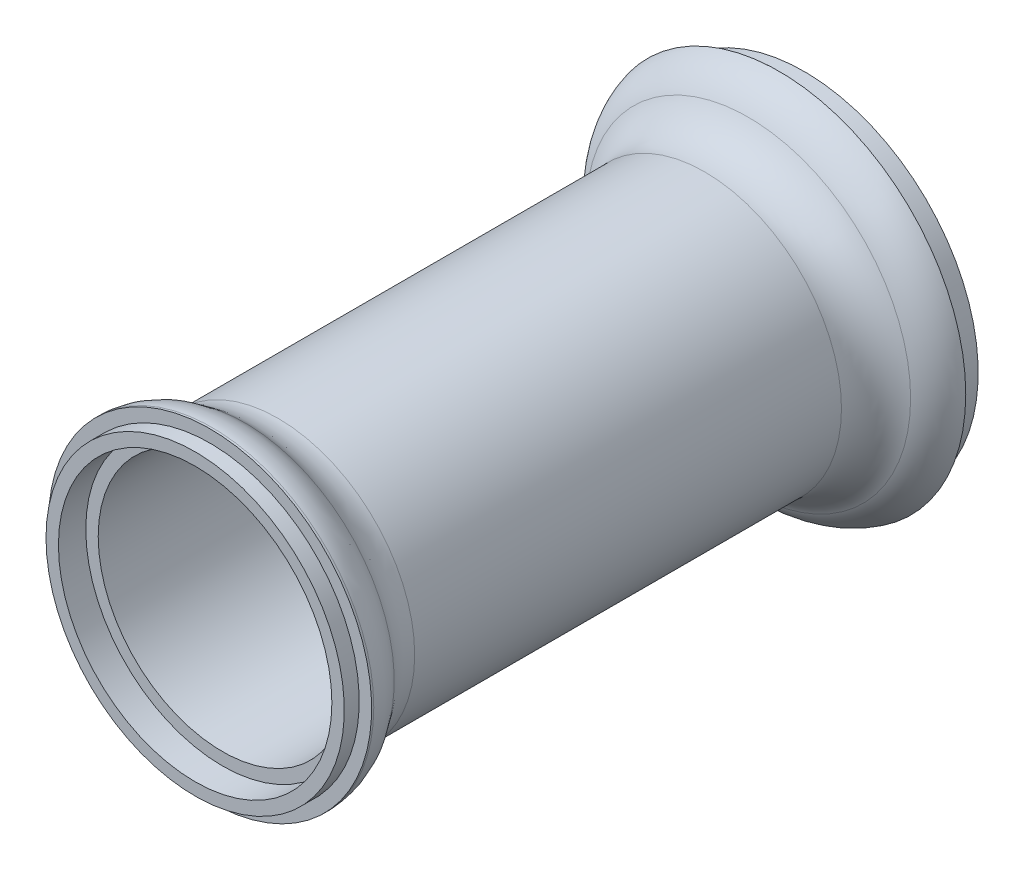
ISO-10303-21;
HEADER;
FILE_DESCRIPTION(('STEP AP214'),'2;1');
FILE_NAME('part.step','',(''),(''),'','','');
FILE_SCHEMA(('AUTOMOTIVE_DESIGN { 1 0 10303 214 1 1 1 1 }'));
ENDSEC;
DATA;
#1=APPLICATION_CONTEXT('core data for automotive mechanical design processes');
#2=APPLICATION_PROTOCOL_DEFINITION('international standard','automotive_design',2000,#1);
#3=PRODUCT_CONTEXT('',#1,'mechanical');
#4=PRODUCT('Part','Part','',(#3));
#5=PRODUCT_RELATED_PRODUCT_CATEGORY('part','',(#4));
#6=PRODUCT_DEFINITION_FORMATION('','',#4);
#7=PRODUCT_DEFINITION_CONTEXT('part definition',#1,'design');
#8=PRODUCT_DEFINITION('design','',#6,#7);
#9=PRODUCT_DEFINITION_SHAPE('','',#8);
#10=(LENGTH_UNIT() NAMED_UNIT(*) SI_UNIT(.MILLI.,.METRE.));
#11=(NAMED_UNIT(*) PLANE_ANGLE_UNIT() SI_UNIT($,.RADIAN.));
#12=(NAMED_UNIT(*) SI_UNIT($,.STERADIAN.) SOLID_ANGLE_UNIT());
#13=UNCERTAINTY_MEASURE_WITH_UNIT(LENGTH_MEASURE(1.E-05),#10,'distance_accuracy_value','');
#14=(GEOMETRIC_REPRESENTATION_CONTEXT(3) GLOBAL_UNCERTAINTY_ASSIGNED_CONTEXT((#13)) GLOBAL_UNIT_ASSIGNED_CONTEXT((#10,
#11,#12)) REPRESENTATION_CONTEXT('',''));
#15=CARTESIAN_POINT('',(0.,0.,0.));
#16=DIRECTION('',(0.,0.,1.));
#17=DIRECTION('',(1.,0.,0.));
#18=AXIS2_PLACEMENT_3D('',#15,#16,#17);
#19=CARTESIAN_POINT('',(35.,0.,0.));
#20=DIRECTION('',(0.,0.,1.));
#21=DIRECTION('',(1.,0.,0.));
#22=AXIS2_PLACEMENT_3D('',#19,#20,#21);
#23=PLANE('',#22);
#24=CARTESIAN_POINT('',(0.,0.,0.));
#25=DIRECTION('',(0.,0.,1.));
#26=DIRECTION('',(1.,0.,0.));
#27=AXIS2_PLACEMENT_3D('',#24,#25,#26);
#28=CIRCLE('',#27,32.5);
#29=CARTESIAN_POINT('',(32.5,0.,0.));
#30=VERTEX_POINT('',#29);
#31=EDGE_CURVE('E76',#30,#30,#28,.F.);
#32=ORIENTED_EDGE('',*,*,#31,.F.);
#33=EDGE_LOOP('',(#32));
#34=FACE_BOUND('',#33,.T.);
#35=CARTESIAN_POINT('',(0.,0.,0.));
#36=DIRECTION('',(0.,0.,-1.));
#37=DIRECTION('',(-1.,0.,0.));
#38=AXIS2_PLACEMENT_3D('',#35,#36,#37);
#39=CIRCLE('',#38,35.);
#40=CARTESIAN_POINT('',(-35.,0.,0.));
#41=VERTEX_POINT('',#40);
#42=EDGE_CURVE('E72',#41,#41,#39,.T.);
#43=ORIENTED_EDGE('',*,*,#42,.T.);
#44=EDGE_LOOP('',(#43));
#45=FACE_BOUND('',#44,.T.);
#46=ADVANCED_FACE('F34',(#34,#45),#23,.F.);
#47=CARTESIAN_POINT('',(0.,0.,122.5));
#48=DIRECTION('',(0.,0.,-1.));
#49=DIRECTION('',(-1.,0.,0.));
#50=AXIS2_PLACEMENT_3D('',#47,#48,#49);
#51=PLANE('',#50);
#52=CARTESIAN_POINT('',(0.,0.,122.5));
#53=DIRECTION('',(0.,0.,-1.));
#54=DIRECTION('',(-1.,0.,0.));
#55=AXIS2_PLACEMENT_3D('',#52,#53,#54);
#56=CIRCLE('',#55,27.5);
#57=CARTESIAN_POINT('',(-27.5,0.,122.5));
#58=VERTEX_POINT('',#57);
#59=EDGE_CURVE('E75',#58,#58,#56,.T.);
#60=ORIENTED_EDGE('',*,*,#59,.T.);
#61=EDGE_LOOP('',(#60));
#62=FACE_BOUND('',#61,.T.);
#63=CARTESIAN_POINT('',(0.,0.,122.5));
#64=DIRECTION('',(0.,0.,-1.));
#65=DIRECTION('',(-1.,0.,0.));
#66=AXIS2_PLACEMENT_3D('',#63,#64,#65);
#67=CIRCLE('',#66,30.);
#68=CARTESIAN_POINT('',(-30.,0.,122.5));
#69=VERTEX_POINT('',#68);
#70=EDGE_CURVE('E57',#69,#69,#67,.T.);
#71=ORIENTED_EDGE('',*,*,#70,.F.);
#72=EDGE_LOOP('',(#71));
#73=FACE_BOUND('',#72,.T.);
#74=ADVANCED_FACE('F115',(#62,#73),#51,.F.);
#75=CARTESIAN_POINT('',(0.,0.,0.));
#76=DIRECTION('',(0.,0.,-1.));
#77=DIRECTION('',(-1.,0.,0.));
#78=AXIS2_PLACEMENT_3D('',#75,#76,#77);
#79=CYLINDRICAL_SURFACE('',#78,30.);
#80=CARTESIAN_POINT('',(0.,0.,119.5));
#81=DIRECTION('',(0.,0.,-1.));
#82=DIRECTION('',(-1.,0.,0.));
#83=AXIS2_PLACEMENT_3D('',#80,#81,#82);
#84=CIRCLE('',#83,30.);
#85=CARTESIAN_POINT('',(-30.,0.,119.5));
#86=VERTEX_POINT('',#85);
#87=EDGE_CURVE('E60',#86,#86,#84,.T.);
#88=ORIENTED_EDGE('',*,*,#87,.F.);
#89=EDGE_LOOP('',(#88));
#90=FACE_BOUND('',#89,.T.);
#91=ORIENTED_EDGE('',*,*,#70,.T.);
#92=EDGE_LOOP('',(#91));
#93=FACE_BOUND('',#92,.T.);
#94=ADVANCED_FACE('F121',(#90,#93),#79,.T.);
#95=CARTESIAN_POINT('',(30.,0.,119.5));
#96=DIRECTION('',(0.,0.,-1.));
#97=DIRECTION('',(-1.,0.,0.));
#98=AXIS2_PLACEMENT_3D('',#95,#96,#97);
#99=PLANE('',#98);
#100=CARTESIAN_POINT('',(0.,0.,119.5));
#101=DIRECTION('',(0.,0.,-1.));
#102=DIRECTION('',(-1.,0.,0.));
#103=AXIS2_PLACEMENT_3D('',#100,#101,#102);
#104=CIRCLE('',#103,32.5);
#105=CARTESIAN_POINT('',(-32.5,0.,119.5));
#106=VERTEX_POINT('',#105);
#107=EDGE_CURVE('E63',#106,#106,#104,.T.);
#108=ORIENTED_EDGE('',*,*,#107,.F.);
#109=EDGE_LOOP('',(#108));
#110=FACE_BOUND('',#109,.T.);
#111=ORIENTED_EDGE('',*,*,#87,.T.);
#112=EDGE_LOOP('',(#111));
#113=FACE_BOUND('',#112,.T.);
#114=ADVANCED_FACE('F159',(#110,#113),#99,.F.);
#115=CARTESIAN_POINT('',(0.,0.,0.));
#116=DIRECTION('',(0.,0.,-1.));
#117=DIRECTION('',(-1.,0.,0.));
#118=AXIS2_PLACEMENT_3D('',#115,#116,#117);
#119=CYLINDRICAL_SURFACE('',#118,32.5);
#120=CARTESIAN_POINT('',(0.,0.,119.068502517479));
#121=DIRECTION('',(0.,0.,1.));
#122=DIRECTION('',(1.,0.,0.));
#123=AXIS2_PLACEMENT_3D('',#120,#121,#122);
#124=CIRCLE('',#123,32.5);
#125=CARTESIAN_POINT('',(32.5,0.,119.068502517479));
#126=VERTEX_POINT('',#125);
#127=EDGE_CURVE('E41',#126,#126,#124,.T.);
#128=ORIENTED_EDGE('',*,*,#127,.T.);
#129=EDGE_LOOP('',(#128));
#130=FACE_BOUND('',#129,.T.);
#131=ORIENTED_EDGE('',*,*,#107,.T.);
#132=EDGE_LOOP('',(#131));
#133=FACE_BOUND('',#132,.T.);
#134=ADVANCED_FACE('F149',(#130,#133),#119,.T.);
#135=CARTESIAN_POINT('',(0.,0.,0.));
#136=DIRECTION('',(0.,0.,-1.));
#137=DIRECTION('',(-1.,0.,0.));
#138=AXIS2_PLACEMENT_3D('',#135,#136,#137);
#139=CYLINDRICAL_SURFACE('',#138,27.5);
#140=CARTESIAN_POINT('',(0.,0.,20.));
#141=DIRECTION('',(0.,0.,-1.));
#142=DIRECTION('',(-1.,0.,0.));
#143=AXIS2_PLACEMENT_3D('',#140,#141,#142);
#144=CIRCLE('',#143,27.5);
#145=CARTESIAN_POINT('',(-27.5,0.,20.));
#146=VERTEX_POINT('',#145);
#147=EDGE_CURVE('E49',#146,#146,#144,.F.);
#148=ORIENTED_EDGE('',*,*,#147,.T.);
#149=EDGE_LOOP('',(#148));
#150=FACE_BOUND('',#149,.T.);
#151=CARTESIAN_POINT('',(0.,0.,105.839745962156));
#152=DIRECTION('',(0.,0.,1.));
#153=DIRECTION('',(1.,0.,0.));
#154=AXIS2_PLACEMENT_3D('',#151,#152,#153);
#155=CIRCLE('',#154,27.5);
#156=CARTESIAN_POINT('',(27.5,0.,105.839745962156));
#157=VERTEX_POINT('',#156);
#158=EDGE_CURVE('E54',#157,#157,#155,.F.);
#159=ORIENTED_EDGE('',*,*,#158,.T.);
#160=EDGE_LOOP('',(#159));
#161=FACE_BOUND('',#160,.T.);
#162=ADVANCED_FACE('F146',(#150,#161),#139,.T.);
#163=CARTESIAN_POINT('',(37.5,0.,5.));
#164=DIRECTION('',(0.,0.,1.));
#165=DIRECTION('',(1.,0.,0.));
#166=AXIS2_PLACEMENT_3D('',#163,#164,#165);
#167=PLANE('',#166);
#168=CARTESIAN_POINT('',(0.,0.,5.));
#169=DIRECTION('',(0.,0.,-1.));
#170=DIRECTION('',(-1.,0.,0.));
#171=AXIS2_PLACEMENT_3D('',#168,#169,#170);
#172=CIRCLE('',#171,35.);
#173=CARTESIAN_POINT('',(-35.,0.,5.00000000000001));
#174=VERTEX_POINT('',#173);
#175=EDGE_CURVE('E69',#174,#174,#172,.T.);
#176=ORIENTED_EDGE('',*,*,#175,.F.);
#177=EDGE_LOOP('',(#176));
#178=FACE_BOUND('',#177,.T.);
#179=CARTESIAN_POINT('',(0.,0.,5.));
#180=DIRECTION('',(0.,0.,-1.));
#181=DIRECTION('',(-1.,0.,0.));
#182=AXIS2_PLACEMENT_3D('',#179,#180,#181);
#183=CIRCLE('',#182,37.5);
#184=CARTESIAN_POINT('',(-37.5,0.,5.00000000000001));
#185=VERTEX_POINT('',#184);
#186=EDGE_CURVE('E66',#185,#185,#183,.T.);
#187=ORIENTED_EDGE('',*,*,#186,.T.);
#188=EDGE_LOOP('',(#187));
#189=FACE_BOUND('',#188,.T.);
#190=ADVANCED_FACE('F148',(#178,#189),#167,.F.);
#191=CARTESIAN_POINT('',(0.,0.,0.));
#192=DIRECTION('',(0.,0.,-1.));
#193=DIRECTION('',(-1.,0.,0.));
#194=AXIS2_PLACEMENT_3D('',#191,#192,#193);
#195=CYLINDRICAL_SURFACE('',#194,35.);
#196=ORIENTED_EDGE('',*,*,#42,.F.);
#197=EDGE_LOOP('',(#196));
#198=FACE_BOUND('',#197,.T.);
#199=ORIENTED_EDGE('',*,*,#175,.T.);
#200=EDGE_LOOP('',(#199));
#201=FACE_BOUND('',#200,.T.);
#202=ADVANCED_FACE('F156',(#198,#201),#195,.T.);
#203=CARTESIAN_POINT('',(0.,0.,0.));
#204=DIRECTION('',(0.,0.,-1.));
#205=DIRECTION('',(-1.,0.,0.));
#206=AXIS2_PLACEMENT_3D('',#203,#204,#205);
#207=CYLINDRICAL_SURFACE('',#206,27.5);
#208=CARTESIAN_POINT('',(0.,0.,117.));
#209=DIRECTION('',(0.,0.,-1.));
#210=DIRECTION('',(-1.,0.,0.));
#211=AXIS2_PLACEMENT_3D('',#208,#209,#210);
#212=CIRCLE('',#211,27.5);
#213=CARTESIAN_POINT('',(-27.5,0.,117.));
#214=VERTEX_POINT('',#213);
#215=EDGE_CURVE('E82',#214,#214,#212,.T.);
#216=ORIENTED_EDGE('',*,*,#215,.T.);
#217=EDGE_LOOP('',(#216));
#218=FACE_BOUND('',#217,.T.);
#219=ORIENTED_EDGE('',*,*,#59,.F.);
#220=EDGE_LOOP('',(#219));
#221=FACE_BOUND('',#220,.T.);
#222=ADVANCED_FACE('F94',(#218,#221),#207,.F.);
#223=CARTESIAN_POINT('',(32.5,0.,117.));
#224=DIRECTION('',(0.,0.,1.));
#225=DIRECTION('',(1.,0.,0.));
#226=AXIS2_PLACEMENT_3D('',#223,#224,#225);
#227=PLANE('',#226);
#228=ORIENTED_EDGE('',*,*,#215,.F.);
#229=EDGE_LOOP('',(#228));
#230=FACE_BOUND('',#229,.T.);
#231=CARTESIAN_POINT('',(0.,0.,117.));
#232=DIRECTION('',(0.,0.,1.));
#233=DIRECTION('',(1.,0.,0.));
#234=AXIS2_PLACEMENT_3D('',#231,#232,#233);
#235=CIRCLE('',#234,25.);
#236=CARTESIAN_POINT('',(25.,0.,117.));
#237=VERTEX_POINT('',#236);
#238=EDGE_CURVE('E88',#237,#237,#235,.F.);
#239=ORIENTED_EDGE('',*,*,#238,.T.);
#240=EDGE_LOOP('',(#239));
#241=FACE_BOUND('',#240,.T.);
#242=ADVANCED_FACE('F97',(#230,#241),#227,.T.);
#243=CARTESIAN_POINT('',(0.,0.,0.));
#244=DIRECTION('',(0.,0.,-1.));
#245=DIRECTION('',(-1.,0.,0.));
#246=AXIS2_PLACEMENT_3D('',#243,#244,#245);
#247=CYLINDRICAL_SURFACE('',#246,25.);
#248=CARTESIAN_POINT('',(0.,0.,7.5));
#249=DIRECTION('',(0.,0.,-1.));
#250=DIRECTION('',(-1.,0.,0.));
#251=AXIS2_PLACEMENT_3D('',#248,#249,#250);
#252=CIRCLE('',#251,25.);
#253=CARTESIAN_POINT('',(-25.,0.,7.50000000000001));
#254=VERTEX_POINT('',#253);
#255=EDGE_CURVE('E85',#254,#254,#252,.T.);
#256=ORIENTED_EDGE('',*,*,#255,.T.);
#257=EDGE_LOOP('',(#256));
#258=FACE_BOUND('',#257,.T.);
#259=ORIENTED_EDGE('',*,*,#238,.F.);
#260=EDGE_LOOP('',(#259));
#261=FACE_BOUND('',#260,.T.);
#262=ADVANCED_FACE('F100',(#258,#261),#247,.F.);
#263=CARTESIAN_POINT('',(27.5,0.,7.5));
#264=DIRECTION('',(0.,0.,-1.));
#265=DIRECTION('',(-1.,0.,0.));
#266=AXIS2_PLACEMENT_3D('',#263,#264,#265);
#267=PLANE('',#266);
#268=CARTESIAN_POINT('',(0.,0.,7.5));
#269=DIRECTION('',(0.,0.,1.));
#270=DIRECTION('',(1.,0.,0.));
#271=AXIS2_PLACEMENT_3D('',#268,#269,#270);
#272=CIRCLE('',#271,32.5);
#273=CARTESIAN_POINT('',(32.5,0.,7.5));
#274=VERTEX_POINT('',#273);
#275=EDGE_CURVE('E79',#274,#274,#272,.F.);
#276=ORIENTED_EDGE('',*,*,#275,.T.);
#277=EDGE_LOOP('',(#276));
#278=FACE_BOUND('',#277,.T.);
#279=ORIENTED_EDGE('',*,*,#255,.F.);
#280=EDGE_LOOP('',(#279));
#281=FACE_BOUND('',#280,.T.);
#282=ADVANCED_FACE('F105',(#278,#281),#267,.T.);
#283=CARTESIAN_POINT('',(0.,0.,0.));
#284=DIRECTION('',(0.,0.,-1.));
#285=DIRECTION('',(-1.,0.,0.));
#286=AXIS2_PLACEMENT_3D('',#283,#284,#285);
#287=CYLINDRICAL_SURFACE('',#286,32.5);
#288=ORIENTED_EDGE('',*,*,#31,.T.);
#289=EDGE_LOOP('',(#288));
#290=FACE_BOUND('',#289,.T.);
#291=ORIENTED_EDGE('',*,*,#275,.F.);
#292=EDGE_LOOP('',(#291));
#293=FACE_BOUND('',#292,.T.);
#294=ADVANCED_FACE('F111',(#290,#293),#287,.F.);
#295=CARTESIAN_POINT('',(0.,0.,20.));
#296=DIRECTION('',(0.,0.,-1.));
#297=DIRECTION('',(-1.,0.,0.));
#298=AXIS2_PLACEMENT_3D('',#295,#296,#297);
#299=TOROIDAL_SURFACE('',#298,37.5,10.);
#300=CARTESIAN_POINT('',(0.,0.,11.2500000000001));
#301=DIRECTION('',(0.,0.,1.));
#302=DIRECTION('',(1.,0.,0.));
#303=AXIS2_PLACEMENT_3D('',#300,#301,#302);
#304=CIRCLE('',#303,32.6587708172408);
#305=CARTESIAN_POINT('',(32.6587708172408,0.,11.2500000000001));
#306=VERTEX_POINT('',#305);
#307=EDGE_CURVE('E10',#306,#306,#304,.T.);
#308=ORIENTED_EDGE('',*,*,#307,.T.);
#309=EDGE_LOOP('',(#308));
#310=FACE_BOUND('',#309,.T.);
#311=ORIENTED_EDGE('',*,*,#147,.F.);
#312=EDGE_LOOP('',(#311));
#313=FACE_BOUND('',#312,.T.);
#314=ADVANCED_FACE('F128',(#310,#313),#299,.F.);
#315=CARTESIAN_POINT('',(0.,0.,105.839745962156));
#316=DIRECTION('',(0.,0.,1.));
#317=DIRECTION('',(1.,0.,0.));
#318=AXIS2_PLACEMENT_3D('',#315,#316,#317);
#319=TOROIDAL_SURFACE('',#318,37.5,10.);
#320=CARTESIAN_POINT('',(0.,0.,112.454124239817));
#321=DIRECTION('',(0.,0.,-1.));
#322=DIRECTION('',(-1.,0.,0.));
#323=AXIS2_PLACEMENT_3D('',#320,#321,#322);
#324=CIRCLE('',#323,30.);
#325=CARTESIAN_POINT('',(-30.,0.,112.454124239817));
#326=VERTEX_POINT('',#325);
#327=EDGE_CURVE('E45',#326,#326,#324,.T.);
#328=ORIENTED_EDGE('',*,*,#327,.T.);
#329=EDGE_LOOP('',(#328));
#330=FACE_BOUND('',#329,.T.);
#331=ORIENTED_EDGE('',*,*,#158,.F.);
#332=EDGE_LOOP('',(#331));
#333=FACE_BOUND('',#332,.T.);
#334=ADVANCED_FACE('F131',(#330,#333),#319,.F.);
#335=CARTESIAN_POINT('',(0.,0.,119.068502517479));
#336=DIRECTION('',(0.,0.,1.));
#337=DIRECTION('',(1.,0.,0.));
#338=AXIS2_PLACEMENT_3D('',#335,#336,#337);
#339=TOROIDAL_SURFACE('',#338,22.5,10.);
#340=ORIENTED_EDGE('',*,*,#127,.F.);
#341=EDGE_LOOP('',(#340));
#342=FACE_BOUND('',#341,.T.);
#343=ORIENTED_EDGE('',*,*,#327,.F.);
#344=EDGE_LOOP('',(#343));
#345=FACE_BOUND('',#344,.T.);
#346=ADVANCED_FACE('F133',(#342,#345),#339,.T.);
#347=CARTESIAN_POINT('',(0.,0.,2.5));
#348=DIRECTION('',(0.,0.,-1.));
#349=DIRECTION('',(-1.,0.,0.));
#350=AXIS2_PLACEMENT_3D('',#347,#348,#349);
#351=TOROIDAL_SURFACE('',#350,27.8175416344815,10.);
#352=ORIENTED_EDGE('',*,*,#307,.F.);
#353=EDGE_LOOP('',(#352));
#354=FACE_BOUND('',#353,.T.);
#355=ORIENTED_EDGE('',*,*,#186,.F.);
#356=EDGE_LOOP('',(#355));
#357=FACE_BOUND('',#356,.T.);
#358=ADVANCED_FACE('F36',(#354,#357),#351,.T.);
#359=CLOSED_SHELL('',(#46,#74,#94,#114,#134,#162,#190,#202,#222,#242,#262,#282,#294,#314,#334,
#346,#358));
#360=MANIFOLD_SOLID_BREP('B2',#359);
#361=ADVANCED_BREP_SHAPE_REPRESENTATION('',(#18,#360),#14);
#362=SHAPE_DEFINITION_REPRESENTATION(#9,#361);
ENDSEC;
END-ISO-10303-21;
